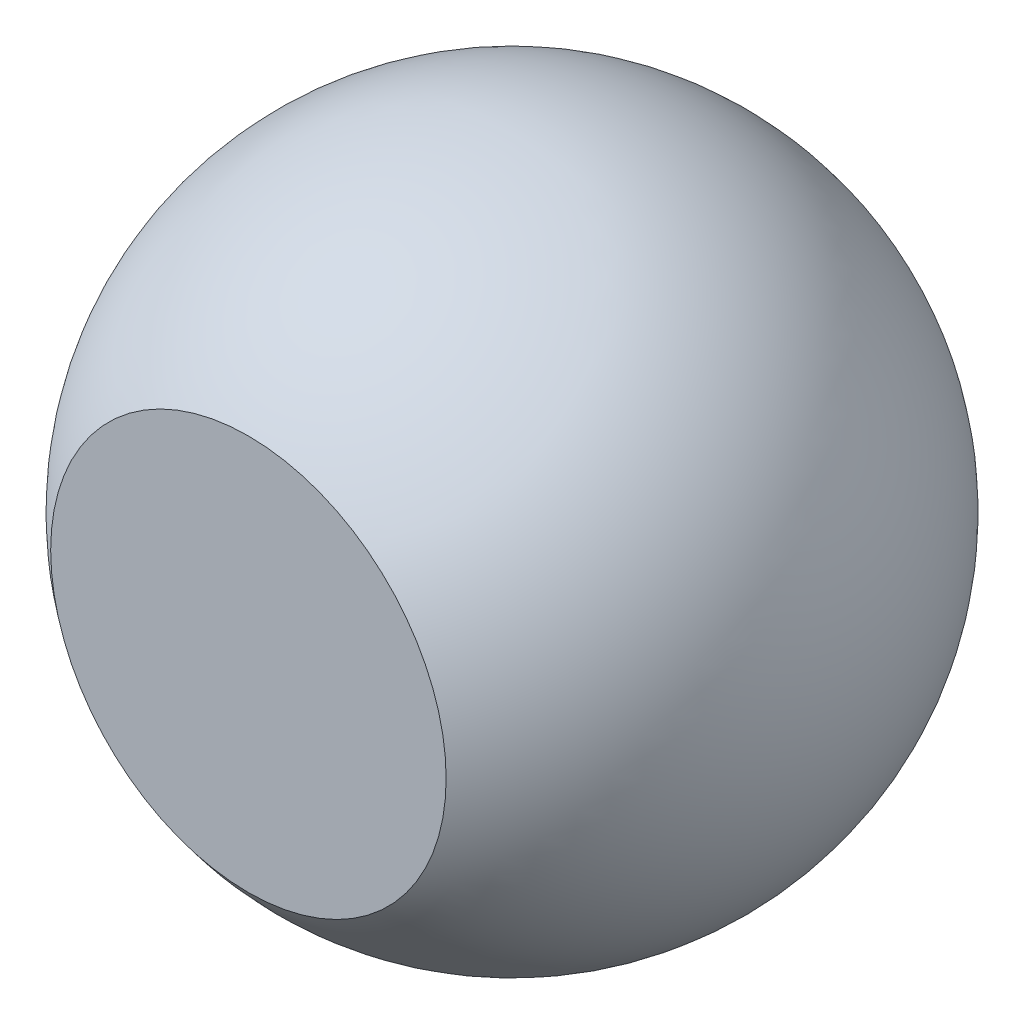
ISO-10303-21;
HEADER;
FILE_DESCRIPTION(('STEP AP214'),'2;1');
FILE_NAME('part.step','',(''),(''),'','','');
FILE_SCHEMA(('AUTOMOTIVE_DESIGN { 1 0 10303 214 1 1 1 1 }'));
ENDSEC;
DATA;
#1=APPLICATION_CONTEXT('core data for automotive mechanical design processes');
#2=APPLICATION_PROTOCOL_DEFINITION('international standard','automotive_design',2000,#1);
#3=PRODUCT_CONTEXT('',#1,'mechanical');
#4=PRODUCT('Part','Part','',(#3));
#5=PRODUCT_RELATED_PRODUCT_CATEGORY('part','',(#4));
#6=PRODUCT_DEFINITION_FORMATION('','',#4);
#7=PRODUCT_DEFINITION_CONTEXT('part definition',#1,'design');
#8=PRODUCT_DEFINITION('design','',#6,#7);
#9=PRODUCT_DEFINITION_SHAPE('','',#8);
#10=(LENGTH_UNIT() NAMED_UNIT(*) SI_UNIT(.MILLI.,.METRE.));
#11=(NAMED_UNIT(*) PLANE_ANGLE_UNIT() SI_UNIT($,.RADIAN.));
#12=(NAMED_UNIT(*) SI_UNIT($,.STERADIAN.) SOLID_ANGLE_UNIT());
#13=UNCERTAINTY_MEASURE_WITH_UNIT(LENGTH_MEASURE(1.E-05),#10,'distance_accuracy_value','');
#14=(GEOMETRIC_REPRESENTATION_CONTEXT(3) GLOBAL_UNCERTAINTY_ASSIGNED_CONTEXT((#13)) GLOBAL_UNIT_ASSIGNED_CONTEXT((#10,
#11,#12)) REPRESENTATION_CONTEXT('',''));
#15=CARTESIAN_POINT('',(0.,0.,0.));
#16=DIRECTION('',(0.,0.,1.));
#17=DIRECTION('',(1.,0.,0.));
#18=AXIS2_PLACEMENT_3D('',#15,#16,#17);
#19=CARTESIAN_POINT('',(0.,0.,-0.2));
#20=DIRECTION('',(0.,0.,1.));
#21=DIRECTION('',(1.,0.,0.));
#22=AXIS2_PLACEMENT_3D('',#19,#20,#21);
#23=PLANE('',#22);
#24=CARTESIAN_POINT('',(0.,0.,-0.2));
#25=DIRECTION('',(0.,0.,-1.));
#26=DIRECTION('',(-1.,0.,0.));
#27=AXIS2_PLACEMENT_3D('',#24,#25,#26);
#28=CIRCLE('',#27,0.15);
#29=CARTESIAN_POINT('',(-0.15,0.,-0.2));
#30=VERTEX_POINT('',#29);
#31=EDGE_CURVE('E41',#30,#30,#28,.T.);
#32=ORIENTED_EDGE('',*,*,#31,.T.);
#33=EDGE_LOOP('',(#32));
#34=FACE_BOUND('',#33,.T.);
#35=ADVANCED_FACE('F35',(#34),#23,.F.);
#36=CARTESIAN_POINT('',(0.,0.,0.2));
#37=DIRECTION('',(0.,0.,-1.));
#38=DIRECTION('',(-1.,0.,0.));
#39=AXIS2_PLACEMENT_3D('',#36,#37,#38);
#40=PLANE('',#39);
#41=CARTESIAN_POINT('',(0.,0.,0.2));
#42=DIRECTION('',(0.,0.,-1.));
#43=DIRECTION('',(-1.,0.,0.));
#44=AXIS2_PLACEMENT_3D('',#41,#42,#43);
#45=CIRCLE('',#44,0.15);
#46=CARTESIAN_POINT('',(-0.15,0.,0.2));
#47=VERTEX_POINT('',#46);
#48=EDGE_CURVE('E10',#47,#47,#45,.T.);
#49=ORIENTED_EDGE('',*,*,#48,.F.);
#50=EDGE_LOOP('',(#49));
#51=FACE_BOUND('',#50,.T.);
#52=ADVANCED_FACE('F50',(#51),#40,.F.);
#53=CARTESIAN_POINT('',(0.,0.,0.));
#54=DIRECTION('',(0.,0.,-1.));
#55=DIRECTION('',(1.,0.,0.));
#56=AXIS2_PLACEMENT_3D('',#53,#54,#55);
#57=SPHERICAL_SURFACE('',#56,0.25);
#58=ORIENTED_EDGE('',*,*,#31,.F.);
#59=EDGE_LOOP('',(#58));
#60=FACE_BOUND('',#59,.T.);
#61=ORIENTED_EDGE('',*,*,#48,.T.);
#62=EDGE_LOOP('',(#61));
#63=FACE_BOUND('',#62,.T.);
#64=ADVANCED_FACE('F48',(#60,#63),#57,.T.);
#65=CLOSED_SHELL('',(#35,#52,#64));
#66=MANIFOLD_SOLID_BREP('B2',#65);
#67=ADVANCED_BREP_SHAPE_REPRESENTATION('',(#18,#66),#14);
#68=SHAPE_DEFINITION_REPRESENTATION(#9,#67);
ENDSEC;
END-ISO-10303-21;
